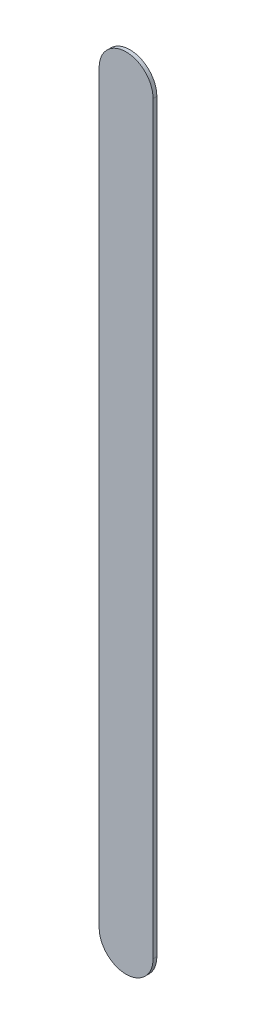
ISO-10303-21;
HEADER;
FILE_DESCRIPTION(('STEP AP214'),'2;1');
FILE_NAME('part.step','',(''),(''),'','','');
FILE_SCHEMA(('AUTOMOTIVE_DESIGN { 1 0 10303 214 1 1 1 1 }'));
ENDSEC;
DATA;
#1=APPLICATION_CONTEXT('core data for automotive mechanical design processes');
#2=APPLICATION_PROTOCOL_DEFINITION('international standard','automotive_design',2000,#1);
#3=PRODUCT_CONTEXT('',#1,'mechanical');
#4=PRODUCT('Part','Part','',(#3));
#5=PRODUCT_RELATED_PRODUCT_CATEGORY('part','',(#4));
#6=PRODUCT_DEFINITION_FORMATION('','',#4);
#7=PRODUCT_DEFINITION_CONTEXT('part definition',#1,'design');
#8=PRODUCT_DEFINITION('design','',#6,#7);
#9=PRODUCT_DEFINITION_SHAPE('','',#8);
#10=(LENGTH_UNIT() NAMED_UNIT(*) SI_UNIT(.MILLI.,.METRE.));
#11=(NAMED_UNIT(*) PLANE_ANGLE_UNIT() SI_UNIT($,.RADIAN.));
#12=(NAMED_UNIT(*) SI_UNIT($,.STERADIAN.) SOLID_ANGLE_UNIT());
#13=UNCERTAINTY_MEASURE_WITH_UNIT(LENGTH_MEASURE(1.E-05),#10,'distance_accuracy_value','');
#14=(GEOMETRIC_REPRESENTATION_CONTEXT(3) GLOBAL_UNCERTAINTY_ASSIGNED_CONTEXT((#13)) GLOBAL_UNIT_ASSIGNED_CONTEXT((#10,
#11,#12)) REPRESENTATION_CONTEXT('',''));
#15=CARTESIAN_POINT('',(0.,0.,0.));
#16=DIRECTION('',(0.,0.,1.));
#17=DIRECTION('',(1.,0.,0.));
#18=AXIS2_PLACEMENT_3D('',#15,#16,#17);
#19=CARTESIAN_POINT('',(176.890003,-106.528003,0.));
#20=DIRECTION('',(0.,0.,1.));
#21=DIRECTION('',(1.,0.,0.));
#22=AXIS2_PLACEMENT_3D('',#19,#20,#21);
#23=PLANE('',#22);
#24=DIRECTION('',(0.,-1.,0.));
#25=VECTOR('',#24,1.);
#26=CARTESIAN_POINT('',(176.890003,-106.528003,0.));
#27=LINE('',#26,#25);
#28=CARTESIAN_POINT('',(176.890003,-106.528003,0.));
#29=VERTEX_POINT('',#28);
#30=CARTESIAN_POINT('',(176.890003,-113.435997,0.));
#31=VERTEX_POINT('',#30);
#32=EDGE_CURVE('E91',#29,#31,#27,.T.);
#33=ORIENTED_EDGE('',*,*,#32,.T.);
#34=CARTESIAN_POINT('',(177.140003,-113.435997,0.));
#35=DIRECTION('',(0.,0.,1.));
#36=DIRECTION('',(-1.,0.,0.));
#37=AXIS2_PLACEMENT_3D('',#34,#35,#36);
#38=CIRCLE('',#37,0.25);
#39=CARTESIAN_POINT('',(177.390003,-113.435997,0.));
#40=VERTEX_POINT('',#39);
#41=EDGE_CURVE('E86',#31,#40,#38,.T.);
#42=ORIENTED_EDGE('',*,*,#41,.T.);
#43=DIRECTION('',(0.,1.,0.));
#44=VECTOR('',#43,1.);
#45=CARTESIAN_POINT('',(177.390003,-113.435997,0.));
#46=LINE('',#45,#44);
#47=CARTESIAN_POINT('',(177.390003,-106.528003,0.));
#48=VERTEX_POINT('',#47);
#49=EDGE_CURVE('E107',#40,#48,#46,.T.);
#50=ORIENTED_EDGE('',*,*,#49,.T.);
#51=CARTESIAN_POINT('',(177.140003,-106.528003,0.));
#52=DIRECTION('',(0.,0.,1.));
#53=DIRECTION('',(1.,0.,0.));
#54=AXIS2_PLACEMENT_3D('',#51,#52,#53);
#55=CIRCLE('',#54,0.25);
#56=EDGE_CURVE('E11',#48,#29,#55,.T.);
#57=ORIENTED_EDGE('',*,*,#56,.T.);
#58=EDGE_LOOP('',(#33,#42,#50,#57));
#59=FACE_BOUND('',#58,.T.);
#60=ADVANCED_FACE('F17',(#59),#23,.T.);
#61=CARTESIAN_POINT('',(176.890003,-106.528003,-0.035));
#62=DIRECTION('',(0.,0.,1.));
#63=DIRECTION('',(1.,0.,0.));
#64=AXIS2_PLACEMENT_3D('',#61,#62,#63);
#65=PLANE('',#64);
#66=CARTESIAN_POINT('',(177.140003,-106.528003,-0.035));
#67=DIRECTION('',(0.,0.,1.));
#68=DIRECTION('',(1.,0.,0.));
#69=AXIS2_PLACEMENT_3D('',#66,#67,#68);
#70=CIRCLE('',#69,0.25);
#71=CARTESIAN_POINT('',(177.390003,-106.528003,-0.035));
#72=VERTEX_POINT('',#71);
#73=CARTESIAN_POINT('',(176.890003,-106.528003,-0.035));
#74=VERTEX_POINT('',#73);
#75=EDGE_CURVE('E26',#72,#74,#70,.T.);
#76=ORIENTED_EDGE('',*,*,#75,.F.);
#77=DIRECTION('',(0.,1.,0.));
#78=VECTOR('',#77,1.);
#79=CARTESIAN_POINT('',(177.390003,-113.435997,-0.035));
#80=LINE('',#79,#78);
#81=CARTESIAN_POINT('',(177.390003,-113.435997,-0.035));
#82=VERTEX_POINT('',#81);
#83=EDGE_CURVE('E20',#82,#72,#80,.T.);
#84=ORIENTED_EDGE('',*,*,#83,.F.);
#85=CARTESIAN_POINT('',(177.140003,-113.435997,-0.035));
#86=DIRECTION('',(0.,0.,1.));
#87=DIRECTION('',(-1.,0.,0.));
#88=AXIS2_PLACEMENT_3D('',#85,#86,#87);
#89=CIRCLE('',#88,0.25);
#90=CARTESIAN_POINT('',(176.890003,-113.435997,-0.035));
#91=VERTEX_POINT('',#90);
#92=EDGE_CURVE('E69',#91,#82,#89,.T.);
#93=ORIENTED_EDGE('',*,*,#92,.F.);
#94=DIRECTION('',(0.,-1.,0.));
#95=VECTOR('',#94,1.);
#96=CARTESIAN_POINT('',(176.890003,-106.528003,-0.035));
#97=LINE('',#96,#95);
#98=EDGE_CURVE('E73',#74,#91,#97,.T.);
#99=ORIENTED_EDGE('',*,*,#98,.F.);
#100=EDGE_LOOP('',(#76,#84,#93,#99));
#101=FACE_BOUND('',#100,.T.);
#102=ADVANCED_FACE('F71',(#101),#65,.F.);
#103=CARTESIAN_POINT('',(177.140003,-106.528003,-0.035));
#104=DIRECTION('',(0.,0.,-1.));
#105=DIRECTION('',(1.,0.,0.));
#106=AXIS2_PLACEMENT_3D('',#103,#104,#105);
#107=CYLINDRICAL_SURFACE('',#106,0.25);
#108=ORIENTED_EDGE('',*,*,#75,.T.);
#109=DIRECTION('',(0.,0.,1.));
#110=VECTOR('',#109,1.);
#111=CARTESIAN_POINT('',(176.890003,-106.528003,-0.035));
#112=LINE('',#111,#110);
#113=EDGE_CURVE('E80',#74,#29,#112,.T.);
#114=ORIENTED_EDGE('',*,*,#113,.T.);
#115=ORIENTED_EDGE('',*,*,#56,.F.);
#116=DIRECTION('',(0.,0.,1.));
#117=VECTOR('',#116,1.);
#118=CARTESIAN_POINT('',(177.390003,-106.528003,-0.035));
#119=LINE('',#118,#117);
#120=EDGE_CURVE('E112',#72,#48,#119,.T.);
#121=ORIENTED_EDGE('',*,*,#120,.F.);
#122=EDGE_LOOP('',(#108,#114,#115,#121));
#123=FACE_BOUND('',#122,.T.);
#124=ADVANCED_FACE('F124',(#123),#107,.T.);
#125=CARTESIAN_POINT('',(177.390003,-113.435997,-0.035));
#126=DIRECTION('',(-1.,0.,0.));
#127=DIRECTION('',(0.,0.,1.));
#128=AXIS2_PLACEMENT_3D('',#125,#126,#127);
#129=PLANE('',#128);
#130=ORIENTED_EDGE('',*,*,#83,.T.);
#131=ORIENTED_EDGE('',*,*,#120,.T.);
#132=ORIENTED_EDGE('',*,*,#49,.F.);
#133=DIRECTION('',(0.,0.,1.));
#134=VECTOR('',#133,1.);
#135=CARTESIAN_POINT('',(177.390003,-113.435997,-0.035));
#136=LINE('',#135,#134);
#137=EDGE_CURVE('E79',#82,#40,#136,.T.);
#138=ORIENTED_EDGE('',*,*,#137,.F.);
#139=EDGE_LOOP('',(#130,#131,#132,#138));
#140=FACE_BOUND('',#139,.T.);
#141=ADVANCED_FACE('F122',(#140),#129,.F.);
#142=CARTESIAN_POINT('',(177.140003,-113.435997,-0.035));
#143=DIRECTION('',(0.,0.,-1.));
#144=DIRECTION('',(-1.,0.,0.));
#145=AXIS2_PLACEMENT_3D('',#142,#143,#144);
#146=CYLINDRICAL_SURFACE('',#145,0.25);
#147=ORIENTED_EDGE('',*,*,#92,.T.);
#148=ORIENTED_EDGE('',*,*,#137,.T.);
#149=ORIENTED_EDGE('',*,*,#41,.F.);
#150=DIRECTION('',(0.,0.,1.));
#151=VECTOR('',#150,1.);
#152=CARTESIAN_POINT('',(176.890003,-113.435997,-0.035));
#153=LINE('',#152,#151);
#154=EDGE_CURVE('E83',#91,#31,#153,.T.);
#155=ORIENTED_EDGE('',*,*,#154,.F.);
#156=EDGE_LOOP('',(#147,#148,#149,#155));
#157=FACE_BOUND('',#156,.T.);
#158=ADVANCED_FACE('F84',(#157),#146,.T.);
#159=CARTESIAN_POINT('',(176.890003,-106.528003,-0.035));
#160=DIRECTION('',(1.,0.,0.));
#161=DIRECTION('',(0.,1.,0.));
#162=AXIS2_PLACEMENT_3D('',#159,#160,#161);
#163=PLANE('',#162);
#164=ORIENTED_EDGE('',*,*,#98,.T.);
#165=ORIENTED_EDGE('',*,*,#154,.T.);
#166=ORIENTED_EDGE('',*,*,#32,.F.);
#167=ORIENTED_EDGE('',*,*,#113,.F.);
#168=EDGE_LOOP('',(#164,#165,#166,#167));
#169=FACE_BOUND('',#168,.T.);
#170=ADVANCED_FACE('F94',(#169),#163,.F.);
#171=CLOSED_SHELL('',(#60,#102,#124,#141,#158,#170));
#172=MANIFOLD_SOLID_BREP('B1',#171);
#173=ADVANCED_BREP_SHAPE_REPRESENTATION('',(#18,#172),#14);
#174=SHAPE_DEFINITION_REPRESENTATION(#9,#173);
ENDSEC;
END-ISO-10303-21;
